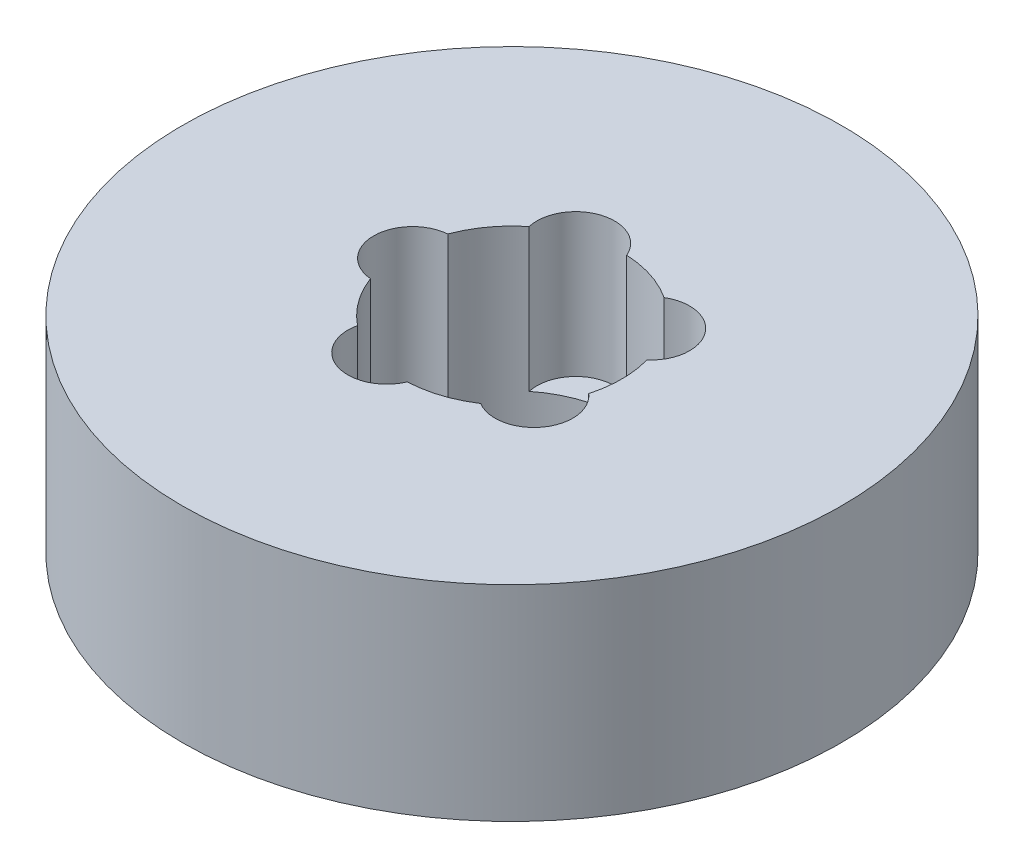
ISO-10303-21;
HEADER;
FILE_DESCRIPTION(('STEP AP214'),'2;1');
FILE_NAME('part.step','',(''),(''),'','','');
FILE_SCHEMA(('AUTOMOTIVE_DESIGN { 1 0 10303 214 1 1 1 1 }'));
ENDSEC;
DATA;
#1=APPLICATION_CONTEXT('core data for automotive mechanical design processes');
#2=APPLICATION_PROTOCOL_DEFINITION('international standard','automotive_design',2000,#1);
#3=PRODUCT_CONTEXT('',#1,'mechanical');
#4=PRODUCT('Part','Part','',(#3));
#5=PRODUCT_RELATED_PRODUCT_CATEGORY('part','',(#4));
#6=PRODUCT_DEFINITION_FORMATION('','',#4);
#7=PRODUCT_DEFINITION_CONTEXT('part definition',#1,'design');
#8=PRODUCT_DEFINITION('design','',#6,#7);
#9=PRODUCT_DEFINITION_SHAPE('','',#8);
#10=(LENGTH_UNIT() NAMED_UNIT(*) SI_UNIT(.MILLI.,.METRE.));
#11=(NAMED_UNIT(*) PLANE_ANGLE_UNIT() SI_UNIT($,.RADIAN.));
#12=(NAMED_UNIT(*) SI_UNIT($,.STERADIAN.) SOLID_ANGLE_UNIT());
#13=UNCERTAINTY_MEASURE_WITH_UNIT(LENGTH_MEASURE(1.E-05),#10,'distance_accuracy_value','');
#14=(GEOMETRIC_REPRESENTATION_CONTEXT(3) GLOBAL_UNCERTAINTY_ASSIGNED_CONTEXT((#13)) GLOBAL_UNIT_ASSIGNED_CONTEXT((#10,
#11,#12)) REPRESENTATION_CONTEXT('',''));
#15=CARTESIAN_POINT('',(0.,0.,0.));
#16=DIRECTION('',(0.,0.,1.));
#17=DIRECTION('',(1.,0.,0.));
#18=AXIS2_PLACEMENT_3D('',#15,#16,#17);
#19=CARTESIAN_POINT('',(0.,14.,0.));
#20=DIRECTION('',(0.,-1.,0.));
#21=DIRECTION('',(0.,0.,-1.));
#22=AXIS2_PLACEMENT_3D('',#19,#20,#21);
#23=CYLINDRICAL_SURFACE('',#22,22.5);
#24=CARTESIAN_POINT('',(0.,14.,0.));
#25=DIRECTION('',(0.,1.,0.));
#26=DIRECTION('',(0.,0.,1.));
#27=AXIS2_PLACEMENT_3D('',#24,#25,#26);
#28=CIRCLE('',#27,22.5);
#29=CARTESIAN_POINT('',(0.,14.,22.5));
#30=VERTEX_POINT('',#29);
#31=EDGE_CURVE('E151',#30,#30,#28,.T.);
#32=ORIENTED_EDGE('',*,*,#31,.F.);
#33=EDGE_LOOP('',(#32));
#34=FACE_BOUND('',#33,.T.);
#35=CARTESIAN_POINT('',(0.,0.,0.));
#36=DIRECTION('',(0.,1.,0.));
#37=DIRECTION('',(0.,0.,1.));
#38=AXIS2_PLACEMENT_3D('',#35,#36,#37);
#39=CIRCLE('',#38,22.5);
#40=CARTESIAN_POINT('',(0.,0.,22.5));
#41=VERTEX_POINT('',#40);
#42=EDGE_CURVE('E150',#41,#41,#39,.T.);
#43=ORIENTED_EDGE('',*,*,#42,.T.);
#44=EDGE_LOOP('',(#43));
#45=FACE_BOUND('',#44,.T.);
#46=ADVANCED_FACE('F39',(#34,#45),#23,.T.);
#47=CARTESIAN_POINT('',(0.,14.,0.));
#48=DIRECTION('',(0.,1.,0.));
#49=DIRECTION('',(0.,0.,1.));
#50=AXIS2_PLACEMENT_3D('',#47,#48,#49);
#51=PLANE('',#50);
#52=CARTESIAN_POINT('',(-2.09711485292874,14.,-6.45425585842424));
#53=DIRECTION('',(0.,1.,0.));
#54=DIRECTION('',(-0.95105651629515,0.,0.309016994374958));
#55=AXIS2_PLACEMENT_3D('',#52,#53,#54);
#56=CIRCLE('',#55,2.65245873359922);
#57=CARTESIAN_POINT('',(0.343866523439693,14.,-7.4921129071883));
#58=VERTEX_POINT('',#57);
#59=CARTESIAN_POINT('',(-4.68194733661484,14.,-5.85912699445618));
#60=VERTEX_POINT('',#59);
#61=EDGE_CURVE('E196',#58,#60,#56,.T.);
#62=ORIENTED_EDGE('',*,*,#61,.F.);
#63=CARTESIAN_POINT('',(0.,14.,0.));
#64=DIRECTION('',(0.,1.,0.));
#65=DIRECTION('',(0.,0.,1.));
#66=AXIS2_PLACEMENT_3D('',#63,#64,#65);
#67=CIRCLE('',#66,7.5);
#68=CARTESIAN_POINT('',(4.1255596140959,14.,-6.26336633692624));
#69=VERTEX_POINT('',#68);
#70=EDGE_CURVE('E156',#69,#58,#67,.T.);
#71=ORIENTED_EDGE('',*,*,#70,.F.);
#72=CARTESIAN_POINT('',(5.49031796327945,14.,-3.98894949259437));
#73=DIRECTION('',(0.,1.,0.));
#74=DIRECTION('',(-0.58778525229248,0.,-0.809016994374942));
#75=AXIS2_PLACEMENT_3D('',#72,#73,#74);
#76=CIRCLE('',#75,2.65245873359922);
#77=CARTESIAN_POINT('',(7.23168340073996,14.,-1.98815371424398));
#78=VERTEX_POINT('',#77);
#79=EDGE_CURVE('E254',#78,#69,#76,.T.);
#80=ORIENTED_EDGE('',*,*,#79,.F.);
#81=CARTESIAN_POINT('',(7.23168340073999,14.,1.98815371424387));
#82=VERTEX_POINT('',#81);
#83=EDGE_CURVE('E153',#82,#78,#67,.T.);
#84=ORIENTED_EDGE('',*,*,#83,.F.);
#85=CARTESIAN_POINT('',(5.49031796327951,14.,3.98894949259429));
#86=DIRECTION('',(0.,1.,0.));
#87=DIRECTION('',(0.587785252292469,0.,-0.809016994374951));
#88=AXIS2_PLACEMENT_3D('',#85,#86,#87);
#89=CIRCLE('',#88,2.65245873359922);
#90=CARTESIAN_POINT('',(4.12555961409599,14.,6.26336633692619));
#91=VERTEX_POINT('',#90);
#92=EDGE_CURVE('E248',#91,#82,#89,.T.);
#93=ORIENTED_EDGE('',*,*,#92,.F.);
#94=CARTESIAN_POINT('',(0.343866523439799,14.,7.49211290718829));
#95=VERTEX_POINT('',#94);
#96=EDGE_CURVE('E140',#95,#91,#67,.T.);
#97=ORIENTED_EDGE('',*,*,#96,.F.);
#98=CARTESIAN_POINT('',(-2.09711485292865,14.,6.45425585842427));
#99=DIRECTION('',(0.,1.,0.));
#100=DIRECTION('',(0.951056516295155,0.,0.309016994374945));
#101=AXIS2_PLACEMENT_3D('',#98,#99,#100);
#102=CIRCLE('',#101,2.65245873359922);
#103=CARTESIAN_POINT('',(-4.68194733661476,14.,5.85912699445625));
#104=VERTEX_POINT('',#103);
#105=EDGE_CURVE('E117',#104,#95,#102,.T.);
#106=ORIENTED_EDGE('',*,*,#105,.F.);
#107=CARTESIAN_POINT('',(-7.01916220166093,14.,2.64222670995024));
#108=VERTEX_POINT('',#107);
#109=EDGE_CURVE('E133',#108,#104,#67,.T.);
#110=ORIENTED_EDGE('',*,*,#109,.F.);
#111=CARTESIAN_POINT('',(-6.78640622070164,14.,0.));
#112=DIRECTION('',(0.,1.,0.));
#113=DIRECTION('',(0.,0.,1.));
#114=AXIS2_PLACEMENT_3D('',#111,#112,#113);
#115=CIRCLE('',#114,2.65245873359922);
#116=CARTESIAN_POINT('',(-7.01916220166093,14.,-2.64222670995024));
#117=VERTEX_POINT('',#116);
#118=EDGE_CURVE('E170',#117,#108,#115,.T.);
#119=ORIENTED_EDGE('',*,*,#118,.F.);
#120=EDGE_CURVE('E149',#60,#117,#67,.T.);
#121=ORIENTED_EDGE('',*,*,#120,.F.);
#122=EDGE_LOOP('',(#62,#71,#80,#84,#93,#97,#106,#110,#119,#121));
#123=FACE_BOUND('',#122,.T.);
#124=ORIENTED_EDGE('',*,*,#31,.T.);
#125=EDGE_LOOP('',(#124));
#126=FACE_BOUND('',#125,.T.);
#127=ADVANCED_FACE('F131',(#123,#126),#51,.T.);
#128=CARTESIAN_POINT('',(0.,0.,0.));
#129=DIRECTION('',(0.,1.,0.));
#130=DIRECTION('',(0.,0.,1.));
#131=AXIS2_PLACEMENT_3D('',#128,#129,#130);
#132=PLANE('',#131);
#133=CARTESIAN_POINT('',(0.,0.,0.));
#134=DIRECTION('',(0.,1.,0.));
#135=DIRECTION('',(0.,0.,1.));
#136=AXIS2_PLACEMENT_3D('',#133,#134,#135);
#137=CIRCLE('',#136,7.5);
#138=CARTESIAN_POINT('',(0.,0.,7.5));
#139=VERTEX_POINT('',#138);
#140=EDGE_CURVE('E160',#139,#139,#137,.T.);
#141=ORIENTED_EDGE('',*,*,#140,.T.);
#142=EDGE_LOOP('',(#141));
#143=FACE_BOUND('',#142,.T.);
#144=ORIENTED_EDGE('',*,*,#42,.F.);
#145=EDGE_LOOP('',(#144));
#146=FACE_BOUND('',#145,.T.);
#147=ADVANCED_FACE('F212',(#143,#146),#132,.F.);
#148=CARTESIAN_POINT('',(0.,14.,0.));
#149=DIRECTION('',(0.,-1.,0.));
#150=DIRECTION('',(0.,0.,-1.));
#151=AXIS2_PLACEMENT_3D('',#148,#149,#150);
#152=CYLINDRICAL_SURFACE('',#151,7.5);
#153=DIRECTION('',(0.,1.,0.));
#154=VECTOR('',#153,1.);
#155=CARTESIAN_POINT('',(0.343866523439693,9.12615301450449,-7.4921129071883));
#156=LINE('',#155,#154);
#157=CARTESIAN_POINT('',(0.343866523439693,4.25230602900899,-7.4921129071883));
#158=VERTEX_POINT('',#157);
#159=EDGE_CURVE('E11',#158,#58,#156,.T.);
#160=ORIENTED_EDGE('',*,*,#159,.F.);
#161=CARTESIAN_POINT('',(0.,4.25230602900899,0.));
#162=DIRECTION('',(0.,1.,0.));
#163=DIRECTION('',(0.,0.,1.));
#164=AXIS2_PLACEMENT_3D('',#161,#162,#163);
#165=CIRCLE('',#164,7.5);
#166=CARTESIAN_POINT('',(-4.68194733661484,4.25230602900899,-5.85912699445618));
#167=VERTEX_POINT('',#166);
#168=EDGE_CURVE('E193',#158,#167,#165,.T.);
#169=ORIENTED_EDGE('',*,*,#168,.T.);
#170=DIRECTION('',(0.,1.,0.));
#171=VECTOR('',#170,1.);
#172=CARTESIAN_POINT('',(-4.68194733661484,9.12615301450449,-5.85912699445618));
#173=LINE('',#172,#171);
#174=EDGE_CURVE('E46',#60,#167,#173,.F.);
#175=ORIENTED_EDGE('',*,*,#174,.F.);
#176=ORIENTED_EDGE('',*,*,#120,.T.);
#177=DIRECTION('',(0.,1.,0.));
#178=VECTOR('',#177,1.);
#179=CARTESIAN_POINT('',(-7.01916220166093,9.12615301450449,-2.64222670995024));
#180=LINE('',#179,#178);
#181=CARTESIAN_POINT('',(-7.01916220166093,4.25230602900899,-2.64222670995024));
#182=VERTEX_POINT('',#181);
#183=EDGE_CURVE('E174',#182,#117,#180,.T.);
#184=ORIENTED_EDGE('',*,*,#183,.F.);
#185=CARTESIAN_POINT('',(0.,4.25230602900899,0.));
#186=DIRECTION('',(0.,1.,0.));
#187=DIRECTION('',(0.,0.,1.));
#188=AXIS2_PLACEMENT_3D('',#185,#186,#187);
#189=CIRCLE('',#188,7.5);
#190=CARTESIAN_POINT('',(-7.01916220166093,4.25230602900899,2.64222670995024));
#191=VERTEX_POINT('',#190);
#192=EDGE_CURVE('E171',#182,#191,#189,.T.);
#193=ORIENTED_EDGE('',*,*,#192,.T.);
#194=DIRECTION('',(0.,1.,0.));
#195=VECTOR('',#194,1.);
#196=CARTESIAN_POINT('',(-7.01916220166093,9.12615301450449,2.64222670995024));
#197=LINE('',#196,#195);
#198=EDGE_CURVE('E148',#108,#191,#197,.F.);
#199=ORIENTED_EDGE('',*,*,#198,.F.);
#200=ORIENTED_EDGE('',*,*,#109,.T.);
#201=DIRECTION('',(0.,1.,0.));
#202=VECTOR('',#201,1.);
#203=CARTESIAN_POINT('',(-4.68194733661476,9.12615301450449,5.85912699445625));
#204=LINE('',#203,#202);
#205=CARTESIAN_POINT('',(-4.68194733661476,4.25230602900899,5.85912699445625));
#206=VERTEX_POINT('',#205);
#207=EDGE_CURVE('E111',#206,#104,#204,.T.);
#208=ORIENTED_EDGE('',*,*,#207,.F.);
#209=CARTESIAN_POINT('',(0.,4.25230602900899,0.));
#210=DIRECTION('',(0.,1.,0.));
#211=DIRECTION('',(0.,0.,1.));
#212=AXIS2_PLACEMENT_3D('',#209,#210,#211);
#213=CIRCLE('',#212,7.5);
#214=CARTESIAN_POINT('',(0.343866523439799,4.25230602900899,7.49211290718829));
#215=VERTEX_POINT('',#214);
#216=EDGE_CURVE('E180',#206,#215,#213,.T.);
#217=ORIENTED_EDGE('',*,*,#216,.T.);
#218=DIRECTION('',(0.,1.,0.));
#219=VECTOR('',#218,1.);
#220=CARTESIAN_POINT('',(0.343866523439799,9.12615301450449,7.49211290718829));
#221=LINE('',#220,#219);
#222=EDGE_CURVE('E124',#95,#215,#221,.F.);
#223=ORIENTED_EDGE('',*,*,#222,.F.);
#224=ORIENTED_EDGE('',*,*,#96,.T.);
#225=DIRECTION('',(0.,1.,0.));
#226=VECTOR('',#225,1.);
#227=CARTESIAN_POINT('',(4.12555961409599,9.12615301450449,6.26336633692619));
#228=LINE('',#227,#226);
#229=CARTESIAN_POINT('',(4.12555961409599,4.25230602900899,6.26336633692619));
#230=VERTEX_POINT('',#229);
#231=EDGE_CURVE('E183',#230,#91,#228,.T.);
#232=ORIENTED_EDGE('',*,*,#231,.F.);
#233=CARTESIAN_POINT('',(0.,4.25230602900899,0.));
#234=DIRECTION('',(0.,1.,0.));
#235=DIRECTION('',(0.,0.,1.));
#236=AXIS2_PLACEMENT_3D('',#233,#234,#235);
#237=CIRCLE('',#236,7.5);
#238=CARTESIAN_POINT('',(7.23168340073999,4.25230602900899,1.98815371424387));
#239=VERTEX_POINT('',#238);
#240=EDGE_CURVE('E123',#230,#239,#237,.T.);
#241=ORIENTED_EDGE('',*,*,#240,.T.);
#242=DIRECTION('',(0.,1.,0.));
#243=VECTOR('',#242,1.);
#244=CARTESIAN_POINT('',(7.23168340073999,9.12615301450449,1.98815371424387));
#245=LINE('',#244,#243);
#246=EDGE_CURVE('E185',#82,#239,#245,.F.);
#247=ORIENTED_EDGE('',*,*,#246,.F.);
#248=ORIENTED_EDGE('',*,*,#83,.T.);
#249=DIRECTION('',(0.,1.,0.));
#250=VECTOR('',#249,1.);
#251=CARTESIAN_POINT('',(7.23168340073996,9.12615301450449,-1.98815371424398));
#252=LINE('',#251,#250);
#253=CARTESIAN_POINT('',(7.23168340073996,4.25230602900899,-1.98815371424398));
#254=VERTEX_POINT('',#253);
#255=EDGE_CURVE('E195',#254,#78,#252,.T.);
#256=ORIENTED_EDGE('',*,*,#255,.F.);
#257=CARTESIAN_POINT('',(0.,4.25230602900899,0.));
#258=DIRECTION('',(0.,1.,0.));
#259=DIRECTION('',(0.,0.,1.));
#260=AXIS2_PLACEMENT_3D('',#257,#258,#259);
#261=CIRCLE('',#260,7.5);
#262=CARTESIAN_POINT('',(4.1255596140959,4.25230602900899,-6.26336633692624));
#263=VERTEX_POINT('',#262);
#264=EDGE_CURVE('E190',#254,#263,#261,.T.);
#265=ORIENTED_EDGE('',*,*,#264,.T.);
#266=DIRECTION('',(0.,1.,0.));
#267=VECTOR('',#266,1.);
#268=CARTESIAN_POINT('',(4.1255596140959,9.12615301450449,-6.26336633692624));
#269=LINE('',#268,#267);
#270=EDGE_CURVE('E189',#69,#263,#269,.F.);
#271=ORIENTED_EDGE('',*,*,#270,.F.);
#272=ORIENTED_EDGE('',*,*,#70,.T.);
#273=EDGE_LOOP('',(#160,#169,#175,#176,#184,#193,#199,#200,#208,#217,#223,#224,#232,#241,#247,
#248,#256,#265,#271,#272));
#274=FACE_BOUND('',#273,.T.);
#275=ORIENTED_EDGE('',*,*,#140,.F.);
#276=EDGE_LOOP('',(#275));
#277=FACE_BOUND('',#276,.T.);
#278=ADVANCED_FACE('F142',(#274,#277),#152,.F.);
#279=CARTESIAN_POINT('',(-6.78640622070164,4.25230602900899,0.));
#280=DIRECTION('',(0.,1.,0.));
#281=DIRECTION('',(0.,0.,1.));
#282=AXIS2_PLACEMENT_3D('',#279,#280,#281);
#283=CYLINDRICAL_SURFACE('',#282,2.65245873359922);
#284=ORIENTED_EDGE('',*,*,#183,.T.);
#285=ORIENTED_EDGE('',*,*,#118,.T.);
#286=ORIENTED_EDGE('',*,*,#198,.T.);
#287=CARTESIAN_POINT('',(-6.78640622070164,4.25230602900899,0.));
#288=DIRECTION('',(0.,1.,0.));
#289=DIRECTION('',(0.,0.,1.));
#290=AXIS2_PLACEMENT_3D('',#287,#288,#289);
#291=CIRCLE('',#290,2.65245873359922);
#292=EDGE_CURVE('E163',#182,#191,#291,.T.);
#293=ORIENTED_EDGE('',*,*,#292,.F.);
#294=EDGE_LOOP('',(#284,#285,#286,#293));
#295=FACE_BOUND('',#294,.T.);
#296=ADVANCED_FACE('F221',(#295),#283,.F.);
#297=CARTESIAN_POINT('',(-6.78640622070164,4.25230602900899,0.));
#298=DIRECTION('',(0.,1.,0.));
#299=DIRECTION('',(0.,0.,1.));
#300=AXIS2_PLACEMENT_3D('',#297,#298,#299);
#301=PLANE('',#300);
#302=ORIENTED_EDGE('',*,*,#292,.T.);
#303=ORIENTED_EDGE('',*,*,#192,.F.);
#304=EDGE_LOOP('',(#302,#303));
#305=FACE_BOUND('',#304,.T.);
#306=ADVANCED_FACE('F227',(#305),#301,.T.);
#307=CARTESIAN_POINT('',(-2.09711485292865,4.25230602900899,6.45425585842427));
#308=DIRECTION('',(0.,1.,0.));
#309=DIRECTION('',(0.,0.,1.));
#310=AXIS2_PLACEMENT_3D('',#307,#308,#309);
#311=CYLINDRICAL_SURFACE('',#310,2.65245873359922);
#312=ORIENTED_EDGE('',*,*,#207,.T.);
#313=ORIENTED_EDGE('',*,*,#105,.T.);
#314=ORIENTED_EDGE('',*,*,#222,.T.);
#315=CARTESIAN_POINT('',(-2.09711485292865,4.25230602900899,6.45425585842427));
#316=DIRECTION('',(0.,1.,0.));
#317=DIRECTION('',(0.951056516295155,0.,0.309016994374945));
#318=AXIS2_PLACEMENT_3D('',#315,#316,#317);
#319=CIRCLE('',#318,2.65245873359922);
#320=EDGE_CURVE('E119',#206,#215,#319,.T.);
#321=ORIENTED_EDGE('',*,*,#320,.F.);
#322=EDGE_LOOP('',(#312,#313,#314,#321));
#323=FACE_BOUND('',#322,.T.);
#324=ADVANCED_FACE('F116',(#323),#311,.F.);
#325=CARTESIAN_POINT('',(-2.09711485292865,4.25230602900899,6.45425585842427));
#326=DIRECTION('',(0.,1.,0.));
#327=DIRECTION('',(0.951056516295155,0.,0.309016994374945));
#328=AXIS2_PLACEMENT_3D('',#325,#326,#327);
#329=PLANE('',#328);
#330=ORIENTED_EDGE('',*,*,#320,.T.);
#331=ORIENTED_EDGE('',*,*,#216,.F.);
#332=EDGE_LOOP('',(#330,#331));
#333=FACE_BOUND('',#332,.T.);
#334=ADVANCED_FACE('F234',(#333),#329,.T.);
#335=CARTESIAN_POINT('',(5.49031796327951,4.25230602900899,3.98894949259429));
#336=DIRECTION('',(0.,1.,0.));
#337=DIRECTION('',(0.,0.,1.));
#338=AXIS2_PLACEMENT_3D('',#335,#336,#337);
#339=CYLINDRICAL_SURFACE('',#338,2.65245873359922);
#340=ORIENTED_EDGE('',*,*,#231,.T.);
#341=ORIENTED_EDGE('',*,*,#92,.T.);
#342=ORIENTED_EDGE('',*,*,#246,.T.);
#343=CARTESIAN_POINT('',(5.49031796327951,4.25230602900899,3.98894949259429));
#344=DIRECTION('',(0.,1.,0.));
#345=DIRECTION('',(0.587785252292469,0.,-0.809016994374951));
#346=AXIS2_PLACEMENT_3D('',#343,#344,#345);
#347=CIRCLE('',#346,2.65245873359922);
#348=EDGE_CURVE('E137',#230,#239,#347,.T.);
#349=ORIENTED_EDGE('',*,*,#348,.F.);
#350=EDGE_LOOP('',(#340,#341,#342,#349));
#351=FACE_BOUND('',#350,.T.);
#352=ADVANCED_FACE('F240',(#351),#339,.F.);
#353=CARTESIAN_POINT('',(5.49031796327951,4.25230602900899,3.98894949259429));
#354=DIRECTION('',(0.,1.,0.));
#355=DIRECTION('',(0.587785252292469,0.,-0.809016994374951));
#356=AXIS2_PLACEMENT_3D('',#353,#354,#355);
#357=PLANE('',#356);
#358=ORIENTED_EDGE('',*,*,#348,.T.);
#359=ORIENTED_EDGE('',*,*,#240,.F.);
#360=EDGE_LOOP('',(#358,#359));
#361=FACE_BOUND('',#360,.T.);
#362=ADVANCED_FACE('F245',(#361),#357,.T.);
#363=CARTESIAN_POINT('',(5.49031796327945,4.25230602900899,-3.98894949259437));
#364=DIRECTION('',(0.,1.,0.));
#365=DIRECTION('',(0.,0.,1.));
#366=AXIS2_PLACEMENT_3D('',#363,#364,#365);
#367=CYLINDRICAL_SURFACE('',#366,2.65245873359922);
#368=ORIENTED_EDGE('',*,*,#255,.T.);
#369=ORIENTED_EDGE('',*,*,#79,.T.);
#370=ORIENTED_EDGE('',*,*,#270,.T.);
#371=CARTESIAN_POINT('',(5.49031796327945,4.25230602900899,-3.98894949259437));
#372=DIRECTION('',(0.,1.,0.));
#373=DIRECTION('',(-0.58778525229248,0.,-0.809016994374942));
#374=AXIS2_PLACEMENT_3D('',#371,#372,#373);
#375=CIRCLE('',#374,2.65245873359922);
#376=EDGE_CURVE('E56',#254,#263,#375,.T.);
#377=ORIENTED_EDGE('',*,*,#376,.F.);
#378=EDGE_LOOP('',(#368,#369,#370,#377));
#379=FACE_BOUND('',#378,.T.);
#380=ADVANCED_FACE('F264',(#379),#367,.F.);
#381=CARTESIAN_POINT('',(5.49031796327945,4.25230602900899,-3.98894949259437));
#382=DIRECTION('',(0.,1.,0.));
#383=DIRECTION('',(-0.58778525229248,0.,-0.809016994374942));
#384=AXIS2_PLACEMENT_3D('',#381,#382,#383);
#385=PLANE('',#384);
#386=ORIENTED_EDGE('',*,*,#376,.T.);
#387=ORIENTED_EDGE('',*,*,#264,.F.);
#388=EDGE_LOOP('',(#386,#387));
#389=FACE_BOUND('',#388,.T.);
#390=ADVANCED_FACE('F202',(#389),#385,.T.);
#391=CARTESIAN_POINT('',(-2.09711485292874,4.25230602900899,-6.45425585842424));
#392=DIRECTION('',(0.,1.,0.));
#393=DIRECTION('',(0.,0.,1.));
#394=AXIS2_PLACEMENT_3D('',#391,#392,#393);
#395=CYLINDRICAL_SURFACE('',#394,2.65245873359922);
#396=ORIENTED_EDGE('',*,*,#159,.T.);
#397=ORIENTED_EDGE('',*,*,#61,.T.);
#398=ORIENTED_EDGE('',*,*,#174,.T.);
#399=CARTESIAN_POINT('',(-2.09711485292874,4.25230602900899,-6.45425585842424));
#400=DIRECTION('',(0.,1.,0.));
#401=DIRECTION('',(-0.95105651629515,0.,0.309016994374958));
#402=AXIS2_PLACEMENT_3D('',#399,#400,#401);
#403=CIRCLE('',#402,2.65245873359922);
#404=EDGE_CURVE('E55',#158,#167,#403,.T.);
#405=ORIENTED_EDGE('',*,*,#404,.F.);
#406=EDGE_LOOP('',(#396,#397,#398,#405));
#407=FACE_BOUND('',#406,.T.);
#408=ADVANCED_FACE('F197',(#407),#395,.F.);
#409=CARTESIAN_POINT('',(-2.09711485292874,4.25230602900899,-6.45425585842424));
#410=DIRECTION('',(0.,1.,0.));
#411=DIRECTION('',(-0.95105651629515,0.,0.309016994374958));
#412=AXIS2_PLACEMENT_3D('',#409,#410,#411);
#413=PLANE('',#412);
#414=ORIENTED_EDGE('',*,*,#404,.T.);
#415=ORIENTED_EDGE('',*,*,#168,.F.);
#416=EDGE_LOOP('',(#414,#415));
#417=FACE_BOUND('',#416,.T.);
#418=ADVANCED_FACE('F200',(#417),#413,.T.);
#419=CLOSED_SHELL('',(#46,#127,#147,#278,#296,#306,#324,#334,#352,#362,#380,#390,#408,#418));
#420=MANIFOLD_SOLID_BREP('B2',#419);
#421=ADVANCED_BREP_SHAPE_REPRESENTATION('',(#18,#420),#14);
#422=SHAPE_DEFINITION_REPRESENTATION(#9,#421);
ENDSEC;
END-ISO-10303-21;
